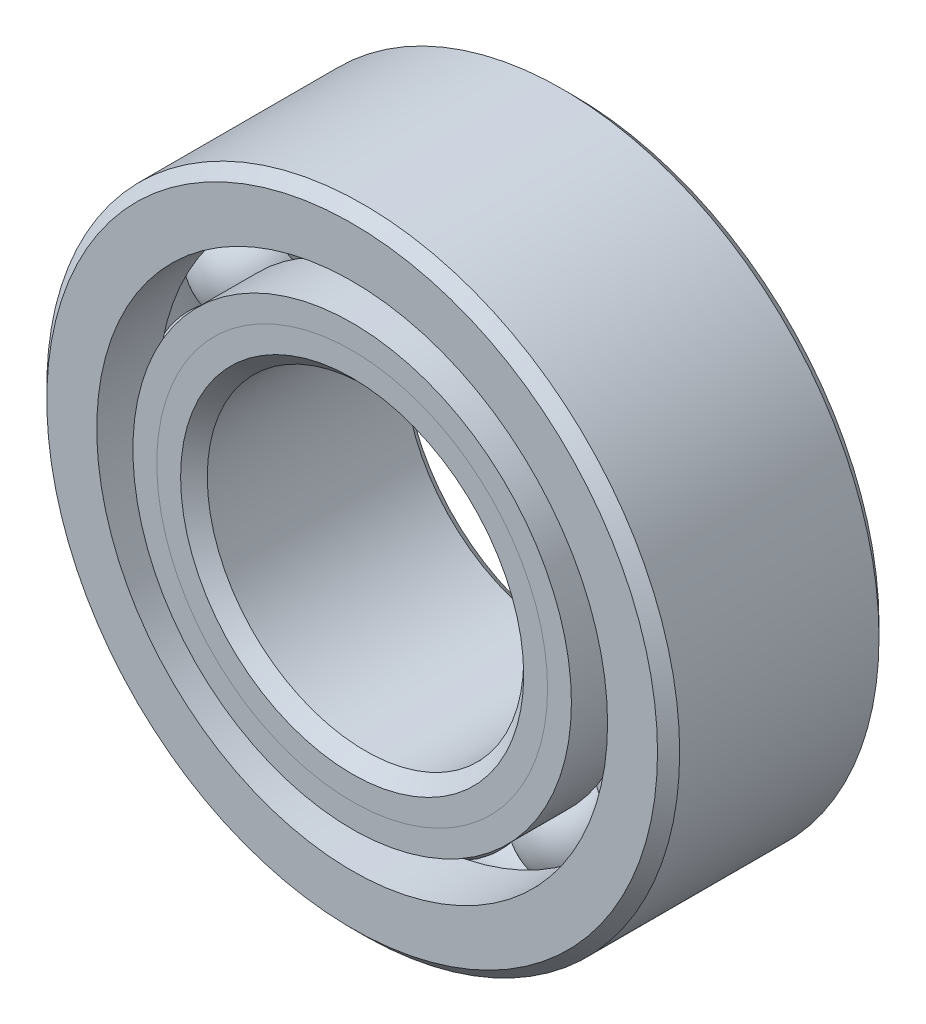
ISO-10303-21;
HEADER;
FILE_DESCRIPTION(('STEP AP214'),'2;1');
FILE_NAME('part.step','',(''),(''),'','','');
FILE_SCHEMA(('AUTOMOTIVE_DESIGN { 1 0 10303 214 1 1 1 1 }'));
ENDSEC;
DATA;
#1=APPLICATION_CONTEXT('core data for automotive mechanical design processes');
#2=APPLICATION_PROTOCOL_DEFINITION('international standard','automotive_design',2000,#1);
#3=PRODUCT_CONTEXT('',#1,'mechanical');
#4=PRODUCT('Part','Part','',(#3));
#5=PRODUCT_RELATED_PRODUCT_CATEGORY('part','',(#4));
#6=PRODUCT_DEFINITION_FORMATION('','',#4);
#7=PRODUCT_DEFINITION_CONTEXT('part definition',#1,'design');
#8=PRODUCT_DEFINITION('design','',#6,#7);
#9=PRODUCT_DEFINITION_SHAPE('','',#8);
#10=(LENGTH_UNIT() NAMED_UNIT(*) SI_UNIT(.MILLI.,.METRE.));
#11=(NAMED_UNIT(*) PLANE_ANGLE_UNIT() SI_UNIT($,.RADIAN.));
#12=(NAMED_UNIT(*) SI_UNIT($,.STERADIAN.) SOLID_ANGLE_UNIT());
#13=UNCERTAINTY_MEASURE_WITH_UNIT(LENGTH_MEASURE(1.E-05),#10,'distance_accuracy_value','');
#14=(GEOMETRIC_REPRESENTATION_CONTEXT(3) GLOBAL_UNCERTAINTY_ASSIGNED_CONTEXT((#13)) GLOBAL_UNIT_ASSIGNED_CONTEXT((#10,
#11,#12)) REPRESENTATION_CONTEXT('',''));
#15=CARTESIAN_POINT('',(0.,0.,0.));
#16=DIRECTION('',(0.,0.,1.));
#17=DIRECTION('',(1.,0.,0.));
#18=AXIS2_PLACEMENT_3D('',#15,#16,#17);
#19=CARTESIAN_POINT('',(-1.48828124999997,2.57777874095214,0.));
#20=DIRECTION('',(0.,0.,1.));
#21=DIRECTION('',(-0.499999999999989,0.866025403784445,0.));
#22=AXIS2_PLACEMENT_3D('',#19,#20,#21);
#23=SPHERICAL_SURFACE('',#22,0.657697880273631);
#24=CARTESIAN_POINT('',(-1.48828124999997,2.57777874095214,0.65769788027363));
#25=VERTEX_POINT('',#24);
#26=VERTEX_LOOP('',#25);
#27=FACE_BOUND('',#26,.T.);
#28=ADVANCED_FACE('F39',(#27),#23,.T.);
#29=CLOSED_SHELL('',(#28));
#30=MANIFOLD_SOLID_BREP('B2',#29);
#31=CARTESIAN_POINT('',(-2.5777787409521,1.48828125000003,0.));
#32=DIRECTION('',(0.,0.,1.));
#33=DIRECTION('',(-0.866025403784433,0.50000000000001,0.));
#34=AXIS2_PLACEMENT_3D('',#31,#32,#33);
#35=SPHERICAL_SURFACE('',#34,0.657697880273631);
#36=CARTESIAN_POINT('',(-2.5777787409521,1.48828125000003,0.65769788027363));
#37=VERTEX_POINT('',#36);
#38=VERTEX_LOOP('',#37);
#39=FACE_BOUND('',#38,.T.);
#40=ADVANCED_FACE('F71',(#39),#35,.T.);
#41=CLOSED_SHELL('',(#40));
#42=MANIFOLD_SOLID_BREP('B6',#41);
#43=CARTESIAN_POINT('',(-2.9765625,0.,0.));
#44=DIRECTION('',(0.,0.,1.));
#45=DIRECTION('',(-1.,0.,0.));
#46=AXIS2_PLACEMENT_3D('',#43,#44,#45);
#47=SPHERICAL_SURFACE('',#46,0.657697880273631);
#48=CARTESIAN_POINT('',(-2.9765625,0.,0.65769788027363));
#49=VERTEX_POINT('',#48);
#50=VERTEX_LOOP('',#49);
#51=FACE_BOUND('',#50,.T.);
#52=ADVANCED_FACE('F103',(#51),#47,.T.);
#53=CLOSED_SHELL('',(#52));
#54=MANIFOLD_SOLID_BREP('B35',#53);
#55=CARTESIAN_POINT('',(-2.57777874095213,-1.48828124999998,0.));
#56=DIRECTION('',(0.,0.,1.));
#57=DIRECTION('',(-0.866025403784443,-0.499999999999992,0.));
#58=AXIS2_PLACEMENT_3D('',#55,#56,#57);
#59=SPHERICAL_SURFACE('',#58,0.657697880273631);
#60=CARTESIAN_POINT('',(-2.57777874095213,-1.48828124999998,0.65769788027363));
#61=VERTEX_POINT('',#60);
#62=VERTEX_LOOP('',#61);
#63=FACE_BOUND('',#62,.T.);
#64=ADVANCED_FACE('F135',(#63),#59,.T.);
#65=CLOSED_SHELL('',(#64));
#66=MANIFOLD_SOLID_BREP('B67',#65);
#67=CARTESIAN_POINT('',(-1.48828125000002,-2.57777874095211,0.));
#68=DIRECTION('',(0.,0.,1.));
#69=DIRECTION('',(-0.500000000000007,-0.866025403784435,0.));
#70=AXIS2_PLACEMENT_3D('',#67,#68,#69);
#71=SPHERICAL_SURFACE('',#70,0.657697880273631);
#72=CARTESIAN_POINT('',(-1.48828125000002,-2.57777874095211,0.65769788027363));
#73=VERTEX_POINT('',#72);
#74=VERTEX_LOOP('',#73);
#75=FACE_BOUND('',#74,.T.);
#76=ADVANCED_FACE('F167',(#75),#71,.T.);
#77=CLOSED_SHELL('',(#76));
#78=MANIFOLD_SOLID_BREP('B99',#77);
#79=CARTESIAN_POINT('',(0.,-2.9765625,0.));
#80=DIRECTION('',(0.,0.,1.));
#81=DIRECTION('',(0.,-1.,0.));
#82=AXIS2_PLACEMENT_3D('',#79,#80,#81);
#83=SPHERICAL_SURFACE('',#82,0.657697880273631);
#84=CARTESIAN_POINT('',(0.,-2.9765625,0.65769788027363));
#85=VERTEX_POINT('',#84);
#86=VERTEX_LOOP('',#85);
#87=FACE_BOUND('',#86,.T.);
#88=ADVANCED_FACE('F199',(#87),#83,.T.);
#89=CLOSED_SHELL('',(#88));
#90=MANIFOLD_SOLID_BREP('B131',#89);
#91=CARTESIAN_POINT('',(1.48828124999999,-2.57777874095213,0.));
#92=DIRECTION('',(0.,0.,1.));
#93=DIRECTION('',(0.499999999999995,-0.866025403784442,0.));
#94=AXIS2_PLACEMENT_3D('',#91,#92,#93);
#95=SPHERICAL_SURFACE('',#94,0.657697880273631);
#96=CARTESIAN_POINT('',(1.48828124999999,-2.57777874095213,0.65769788027363));
#97=VERTEX_POINT('',#96);
#98=VERTEX_LOOP('',#97);
#99=FACE_BOUND('',#98,.T.);
#100=ADVANCED_FACE('F231',(#99),#95,.T.);
#101=CLOSED_SHELL('',(#100));
#102=MANIFOLD_SOLID_BREP('B163',#101);
#103=CARTESIAN_POINT('',(2.57777874095211,-1.48828125000001,0.));
#104=DIRECTION('',(0.,0.,1.));
#105=DIRECTION('',(0.866025403784436,-0.500000000000004,0.));
#106=AXIS2_PLACEMENT_3D('',#103,#104,#105);
#107=SPHERICAL_SURFACE('',#106,0.657697880273631);
#108=CARTESIAN_POINT('',(2.57777874095211,-1.48828125000001,0.65769788027363));
#109=VERTEX_POINT('',#108);
#110=VERTEX_LOOP('',#109);
#111=FACE_BOUND('',#110,.T.);
#112=ADVANCED_FACE('F263',(#111),#107,.T.);
#113=CLOSED_SHELL('',(#112));
#114=MANIFOLD_SOLID_BREP('B195',#113);
#115=CARTESIAN_POINT('',(2.9765625,0.,0.));
#116=DIRECTION('',(0.,0.,1.));
#117=DIRECTION('',(1.,0.,0.));
#118=AXIS2_PLACEMENT_3D('',#115,#116,#117);
#119=SPHERICAL_SURFACE('',#118,0.657697880273631);
#120=CARTESIAN_POINT('',(2.9765625,0.,0.65769788027363));
#121=VERTEX_POINT('',#120);
#122=VERTEX_LOOP('',#121);
#123=FACE_BOUND('',#122,.T.);
#124=ADVANCED_FACE('F295',(#123),#119,.T.);
#125=CLOSED_SHELL('',(#124));
#126=MANIFOLD_SOLID_BREP('B227',#125);
#127=CARTESIAN_POINT('',(2.57777874095212,1.48828124999999,0.));
#128=DIRECTION('',(0.,0.,1.));
#129=DIRECTION('',(0.86602540378444,0.499999999999998,0.));
#130=AXIS2_PLACEMENT_3D('',#127,#128,#129);
#131=SPHERICAL_SURFACE('',#130,0.657697880273631);
#132=CARTESIAN_POINT('',(2.57777874095212,1.48828124999999,0.65769788027363));
#133=VERTEX_POINT('',#132);
#134=VERTEX_LOOP('',#133);
#135=FACE_BOUND('',#134,.T.);
#136=ADVANCED_FACE('F327',(#135),#131,.T.);
#137=CLOSED_SHELL('',(#136));
#138=MANIFOLD_SOLID_BREP('B259',#137);
#139=CARTESIAN_POINT('',(1.48828125,2.57777874095212,0.));
#140=DIRECTION('',(0.,0.,1.));
#141=DIRECTION('',(0.500000000000001,0.866025403784438,0.));
#142=AXIS2_PLACEMENT_3D('',#139,#140,#141);
#143=SPHERICAL_SURFACE('',#142,0.657697880273631);
#144=CARTESIAN_POINT('',(1.48828125,2.57777874095212,0.65769788027363));
#145=VERTEX_POINT('',#144);
#146=VERTEX_LOOP('',#145);
#147=FACE_BOUND('',#146,.T.);
#148=ADVANCED_FACE('F359',(#147),#143,.T.);
#149=CLOSED_SHELL('',(#148));
#150=MANIFOLD_SOLID_BREP('B291',#149);
#151=CARTESIAN_POINT('',(0.,2.9765625,0.));
#152=DIRECTION('',(0.,0.,1.));
#153=DIRECTION('',(0.,1.,0.));
#154=AXIS2_PLACEMENT_3D('',#151,#152,#153);
#155=SPHERICAL_SURFACE('',#154,0.657697880273631);
#156=CARTESIAN_POINT('',(0.,2.9765625,0.65769788027363));
#157=VERTEX_POINT('',#156);
#158=VERTEX_LOOP('',#157);
#159=FACE_BOUND('',#158,.T.);
#160=ADVANCED_FACE('F393',(#159),#155,.T.);
#161=CLOSED_SHELL('',(#160));
#162=MANIFOLD_SOLID_BREP('B323',#161);
#163=CARTESIAN_POINT('',(0.,2.45069829778874,1.3890625));
#164=DIRECTION('',(0.,0.,-1.));
#165=DIRECTION('',(-1.,0.,0.));
#166=AXIS2_PLACEMENT_3D('',#163,#164,#165);
#167=PLANE('',#166);
#168=CARTESIAN_POINT('',(0.,0.,1.3890625));
#169=DIRECTION('',(0.,0.,1.));
#170=DIRECTION('',(1.,0.,0.));
#171=AXIS2_PLACEMENT_3D('',#168,#169,#170);
#172=CIRCLE('',#171,2.15161980986318);
#173=CARTESIAN_POINT('',(2.15161980986318,0.,1.3890625));
#174=VERTEX_POINT('',#173);
#175=EDGE_CURVE('E447',#174,#174,#172,.T.);
#176=ORIENTED_EDGE('',*,*,#175,.F.);
#177=EDGE_LOOP('',(#176));
#178=FACE_BOUND('',#177,.T.);
#179=CARTESIAN_POINT('',(0.,0.,1.3890625));
#180=DIRECTION('',(0.,0.,1.));
#181=DIRECTION('',(1.,0.,0.));
#182=AXIS2_PLACEMENT_3D('',#179,#180,#181);
#183=CIRCLE('',#182,2.45069829778874);
#184=CARTESIAN_POINT('',(2.45069829778874,0.,1.3890625));
#185=VERTEX_POINT('',#184);
#186=EDGE_CURVE('E392',#185,#185,#183,.T.);
#187=ORIENTED_EDGE('',*,*,#186,.T.);
#188=EDGE_LOOP('',(#187));
#189=FACE_BOUND('',#188,.T.);
#190=ADVANCED_FACE('F413',(#178,#189),#167,.F.);
#191=CARTESIAN_POINT('',(0.,0.,1.08998401207445));
#192=DIRECTION('',(0.,0.,1.));
#193=DIRECTION('',(1.,0.,0.));
#194=AXIS2_PLACEMENT_3D('',#191,#192,#193);
#195=CONICAL_SURFACE('',#194,2.15161980986318,0.78539816339745);
#196=ORIENTED_EDGE('',*,*,#186,.F.);
#197=EDGE_LOOP('',(#196));
#198=FACE_BOUND('',#197,.T.);
#199=CARTESIAN_POINT('',(0.,0.,1.08998401207445));
#200=DIRECTION('',(0.,0.,1.));
#201=DIRECTION('',(1.,0.,0.));
#202=AXIS2_PLACEMENT_3D('',#199,#200,#201);
#203=CIRCLE('',#202,2.15161980986318);
#204=CARTESIAN_POINT('',(2.15161980986318,0.,1.08998401207445));
#205=VERTEX_POINT('',#204);
#206=EDGE_CURVE('E419',#205,#205,#203,.T.);
#207=ORIENTED_EDGE('',*,*,#206,.T.);
#208=EDGE_LOOP('',(#207));
#209=FACE_BOUND('',#208,.T.);
#210=ADVANCED_FACE('F454',(#198,#209),#195,.T.);
#211=CARTESIAN_POINT('',(0.,0.,1.3890625));
#212=DIRECTION('',(0.,0.,1.));
#213=DIRECTION('',(1.,0.,0.));
#214=AXIS2_PLACEMENT_3D('',#211,#212,#213);
#215=CYLINDRICAL_SURFACE('',#214,2.15161980986318);
#216=ORIENTED_EDGE('',*,*,#206,.F.);
#217=EDGE_LOOP('',(#216));
#218=FACE_BOUND('',#217,.T.);
#219=CARTESIAN_POINT('',(0.,0.,0.));
#220=DIRECTION('',(0.,0.,1.));
#221=DIRECTION('',(1.,0.,0.));
#222=AXIS2_PLACEMENT_3D('',#219,#220,#221);
#223=CIRCLE('',#222,2.15161980986318);
#224=CARTESIAN_POINT('',(2.15161980986318,0.,0.));
#225=VERTEX_POINT('',#224);
#226=EDGE_CURVE('E423',#225,#225,#223,.T.);
#227=ORIENTED_EDGE('',*,*,#226,.T.);
#228=EDGE_LOOP('',(#227));
#229=FACE_BOUND('',#228,.T.);
#230=ADVANCED_FACE('F458',(#218,#229),#215,.T.);
#231=CARTESIAN_POINT('',(0.,2.15161980986318,0.));
#232=DIRECTION('',(0.,0.,-1.));
#233=DIRECTION('',(-1.,0.,0.));
#234=AXIS2_PLACEMENT_3D('',#231,#232,#233);
#235=PLANE('',#234);
#236=ORIENTED_EDGE('',*,*,#226,.F.);
#237=EDGE_LOOP('',(#236));
#238=FACE_BOUND('',#237,.T.);
#239=CARTESIAN_POINT('',(0.,0.,0.));
#240=DIRECTION('',(0.,0.,1.));
#241=DIRECTION('',(1.,0.,0.));
#242=AXIS2_PLACEMENT_3D('',#239,#240,#241);
#243=CIRCLE('',#242,2.31886461972637);
#244=CARTESIAN_POINT('',(2.31886461972637,0.,0.));
#245=VERTEX_POINT('',#244);
#246=EDGE_CURVE('E427',#245,#245,#243,.T.);
#247=ORIENTED_EDGE('',*,*,#246,.T.);
#248=EDGE_LOOP('',(#247));
#249=FACE_BOUND('',#248,.T.);
#250=ADVANCED_FACE('F463',(#238,#249),#235,.F.);
#251=CARTESIAN_POINT('',(0.,0.,0.));
#252=DIRECTION('',(0.,0.,1.));
#253=DIRECTION('',(1.,0.,0.));
#254=AXIS2_PLACEMENT_3D('',#251,#252,#253);
#255=TOROIDAL_SURFACE('',#254,2.9765625,0.65769788027363);
#256=ORIENTED_EDGE('',*,*,#246,.F.);
#257=EDGE_LOOP('',(#256));
#258=FACE_BOUND('',#257,.T.);
#259=CARTESIAN_POINT('',(0.,0.,-0.617361111111111));
#260=DIRECTION('',(0.,0.,1.));
#261=DIRECTION('',(1.,0.,0.));
#262=AXIS2_PLACEMENT_3D('',#259,#260,#261);
#263=CIRCLE('',#262,2.74977678571429);
#264=CARTESIAN_POINT('',(2.74977678571429,0.,-0.617361111111111));
#265=VERTEX_POINT('',#264);
#266=EDGE_CURVE('E432',#265,#265,#263,.T.);
#267=ORIENTED_EDGE('',*,*,#266,.T.);
#268=EDGE_LOOP('',(#267));
#269=FACE_BOUND('',#268,.T.);
#270=ADVANCED_FACE('F469',(#258,#269),#255,.F.);
#271=CARTESIAN_POINT('',(0.,0.,1.3890625));
#272=DIRECTION('',(0.,0.,1.));
#273=DIRECTION('',(1.,0.,0.));
#274=AXIS2_PLACEMENT_3D('',#271,#272,#273);
#275=CYLINDRICAL_SURFACE('',#274,2.74977678571429);
#276=ORIENTED_EDGE('',*,*,#266,.F.);
#277=EDGE_LOOP('',(#276));
#278=FACE_BOUND('',#277,.T.);
#279=CARTESIAN_POINT('',(0.,0.,-1.3890625));
#280=DIRECTION('',(0.,0.,1.));
#281=DIRECTION('',(1.,0.,0.));
#282=AXIS2_PLACEMENT_3D('',#279,#280,#281);
#283=CIRCLE('',#282,2.74977678571429);
#284=CARTESIAN_POINT('',(2.74977678571429,0.,-1.3890625));
#285=VERTEX_POINT('',#284);
#286=EDGE_CURVE('E435',#285,#285,#283,.T.);
#287=ORIENTED_EDGE('',*,*,#286,.T.);
#288=EDGE_LOOP('',(#287));
#289=FACE_BOUND('',#288,.T.);
#290=ADVANCED_FACE('F473',(#278,#289),#275,.T.);
#291=CARTESIAN_POINT('',(0.,2.12328125,-1.3890625));
#292=DIRECTION('',(0.,0.,1.));
#293=DIRECTION('',(1.,0.,0.));
#294=AXIS2_PLACEMENT_3D('',#291,#292,#293);
#295=PLANE('',#294);
#296=ORIENTED_EDGE('',*,*,#286,.F.);
#297=EDGE_LOOP('',(#296));
#298=FACE_BOUND('',#297,.T.);
#299=CARTESIAN_POINT('',(0.,0.,-1.3890625));
#300=DIRECTION('',(0.,0.,1.));
#301=DIRECTION('',(1.,0.,0.));
#302=AXIS2_PLACEMENT_3D('',#299,#300,#301);
#303=CIRCLE('',#302,2.12328125);
#304=CARTESIAN_POINT('',(2.12328125,0.,-1.3890625));
#305=VERTEX_POINT('',#304);
#306=EDGE_CURVE('E438',#305,#305,#303,.T.);
#307=ORIENTED_EDGE('',*,*,#306,.T.);
#308=EDGE_LOOP('',(#307));
#309=FACE_BOUND('',#308,.T.);
#310=ADVANCED_FACE('F477',(#298,#309),#295,.F.);
#311=CARTESIAN_POINT('',(0.,0.,-1.25015625));
#312=DIRECTION('',(0.,0.,-1.));
#313=DIRECTION('',(-1.,0.,0.));
#314=AXIS2_PLACEMENT_3D('',#311,#312,#313);
#315=CONICAL_SURFACE('',#314,1.984375,0.785398163397448);
#316=ORIENTED_EDGE('',*,*,#306,.F.);
#317=EDGE_LOOP('',(#316));
#318=FACE_BOUND('',#317,.T.);
#319=CARTESIAN_POINT('',(0.,0.,-1.25015625));
#320=DIRECTION('',(0.,0.,1.));
#321=DIRECTION('',(1.,0.,0.));
#322=AXIS2_PLACEMENT_3D('',#319,#320,#321);
#323=CIRCLE('',#322,1.984375);
#324=CARTESIAN_POINT('',(1.984375,0.,-1.25015625));
#325=VERTEX_POINT('',#324);
#326=EDGE_CURVE('E441',#325,#325,#323,.T.);
#327=ORIENTED_EDGE('',*,*,#326,.T.);
#328=EDGE_LOOP('',(#327));
#329=FACE_BOUND('',#328,.T.);
#330=ADVANCED_FACE('F481',(#318,#329),#315,.F.);
#331=CARTESIAN_POINT('',(0.,0.,1.3890625));
#332=DIRECTION('',(0.,0.,1.));
#333=DIRECTION('',(1.,0.,0.));
#334=AXIS2_PLACEMENT_3D('',#331,#332,#333);
#335=CYLINDRICAL_SURFACE('',#334,1.984375);
#336=ORIENTED_EDGE('',*,*,#326,.F.);
#337=EDGE_LOOP('',(#336));
#338=FACE_BOUND('',#337,.T.);
#339=CARTESIAN_POINT('',(0.,0.,1.22181769013682));
#340=DIRECTION('',(0.,0.,1.));
#341=DIRECTION('',(1.,0.,0.));
#342=AXIS2_PLACEMENT_3D('',#339,#340,#341);
#343=CIRCLE('',#342,1.984375);
#344=CARTESIAN_POINT('',(1.984375,0.,1.22181769013682));
#345=VERTEX_POINT('',#344);
#346=EDGE_CURVE('E444',#345,#345,#343,.T.);
#347=ORIENTED_EDGE('',*,*,#346,.T.);
#348=EDGE_LOOP('',(#347));
#349=FACE_BOUND('',#348,.T.);
#350=ADVANCED_FACE('F485',(#338,#349),#335,.F.);
#351=CARTESIAN_POINT('',(0.,0.,1.3890625));
#352=DIRECTION('',(0.,0.,1.));
#353=DIRECTION('',(1.,0.,0.));
#354=AXIS2_PLACEMENT_3D('',#351,#352,#353);
#355=CONICAL_SURFACE('',#354,2.15161980986318,0.78539816339745);
#356=ORIENTED_EDGE('',*,*,#346,.F.);
#357=EDGE_LOOP('',(#356));
#358=FACE_BOUND('',#357,.T.);
#359=ORIENTED_EDGE('',*,*,#175,.T.);
#360=EDGE_LOOP('',(#359));
#361=FACE_BOUND('',#360,.T.);
#362=ADVANCED_FACE('F451',(#358,#361),#355,.F.);
#363=CLOSED_SHELL('',(#190,#210,#230,#250,#270,#290,#310,#330,#350,#362));
#364=MANIFOLD_SOLID_BREP('B355',#363);
#365=CARTESIAN_POINT('',(0.,2.74977678571429,1.3890625));
#366=DIRECTION('',(0.,0.,-1.));
#367=DIRECTION('',(-1.,0.,0.));
#368=AXIS2_PLACEMENT_3D('',#365,#366,#367);
#369=PLANE('',#368);
#370=CARTESIAN_POINT('',(0.,0.,1.3890625));
#371=DIRECTION('',(0.,0.,1.));
#372=DIRECTION('',(1.,0.,0.));
#373=AXIS2_PLACEMENT_3D('',#370,#371,#372);
#374=CIRCLE('',#373,2.45069829778874);
#375=CARTESIAN_POINT('',(2.45069829778874,0.,1.3890625));
#376=VERTEX_POINT('',#375);
#377=EDGE_CURVE('E412',#376,#376,#374,.T.);
#378=ORIENTED_EDGE('',*,*,#377,.F.);
#379=EDGE_LOOP('',(#378));
#380=FACE_BOUND('',#379,.T.);
#381=CARTESIAN_POINT('',(0.,0.,1.3890625));
#382=DIRECTION('',(0.,0.,1.));
#383=DIRECTION('',(1.,0.,0.));
#384=AXIS2_PLACEMENT_3D('',#381,#382,#383);
#385=CIRCLE('',#384,2.74977678571429);
#386=CARTESIAN_POINT('',(2.74977678571429,0.,1.3890625));
#387=VERTEX_POINT('',#386);
#388=EDGE_CURVE('E593',#387,#387,#385,.T.);
#389=ORIENTED_EDGE('',*,*,#388,.T.);
#390=EDGE_LOOP('',(#389));
#391=FACE_BOUND('',#390,.T.);
#392=ADVANCED_FACE('F571',(#380,#391),#369,.F.);
#393=CARTESIAN_POINT('',(0.,0.,1.3890625));
#394=DIRECTION('',(0.,0.,1.));
#395=DIRECTION('',(1.,0.,0.));
#396=AXIS2_PLACEMENT_3D('',#393,#394,#395);
#397=CONICAL_SURFACE('',#396,2.45069829778874,0.78539816339745);
#398=CARTESIAN_POINT('',(0.,0.,1.08998401207445));
#399=DIRECTION('',(0.,0.,1.));
#400=DIRECTION('',(1.,0.,0.));
#401=AXIS2_PLACEMENT_3D('',#398,#399,#400);
#402=CIRCLE('',#401,2.15161980986318);
#403=CARTESIAN_POINT('',(2.15161980986318,0.,1.08998401207445));
#404=VERTEX_POINT('',#403);
#405=EDGE_CURVE('E577',#404,#404,#402,.T.);
#406=ORIENTED_EDGE('',*,*,#405,.F.);
#407=EDGE_LOOP('',(#406));
#408=FACE_BOUND('',#407,.T.);
#409=ORIENTED_EDGE('',*,*,#377,.T.);
#410=EDGE_LOOP('',(#409));
#411=FACE_BOUND('',#410,.T.);
#412=ADVANCED_FACE('F618',(#408,#411),#397,.F.);
#413=CARTESIAN_POINT('',(0.,0.,1.3890625));
#414=DIRECTION('',(0.,0.,1.));
#415=DIRECTION('',(1.,0.,0.));
#416=AXIS2_PLACEMENT_3D('',#413,#414,#415);
#417=CYLINDRICAL_SURFACE('',#416,2.15161980986318);
#418=CARTESIAN_POINT('',(0.,0.,0.));
#419=DIRECTION('',(0.,0.,1.));
#420=DIRECTION('',(1.,0.,0.));
#421=AXIS2_PLACEMENT_3D('',#418,#419,#420);
#422=CIRCLE('',#421,2.15161980986318);
#423=CARTESIAN_POINT('',(2.15161980986318,0.,0.));
#424=VERTEX_POINT('',#423);
#425=EDGE_CURVE('E581',#424,#424,#422,.T.);
#426=ORIENTED_EDGE('',*,*,#425,.F.);
#427=EDGE_LOOP('',(#426));
#428=FACE_BOUND('',#427,.T.);
#429=ORIENTED_EDGE('',*,*,#405,.T.);
#430=EDGE_LOOP('',(#429));
#431=FACE_BOUND('',#430,.T.);
#432=ADVANCED_FACE('F613',(#428,#431),#417,.F.);
#433=CARTESIAN_POINT('',(0.,2.15161980986318,0.));
#434=DIRECTION('',(0.,0.,1.));
#435=DIRECTION('',(1.,0.,0.));
#436=AXIS2_PLACEMENT_3D('',#433,#434,#435);
#437=PLANE('',#436);
#438=CARTESIAN_POINT('',(0.,0.,0.));
#439=DIRECTION('',(0.,0.,1.));
#440=DIRECTION('',(1.,0.,0.));
#441=AXIS2_PLACEMENT_3D('',#438,#439,#440);
#442=CIRCLE('',#441,2.31886461972637);
#443=CARTESIAN_POINT('',(2.31886461972637,0.,0.));
#444=VERTEX_POINT('',#443);
#445=EDGE_CURVE('E585',#444,#444,#442,.T.);
#446=ORIENTED_EDGE('',*,*,#445,.F.);
#447=EDGE_LOOP('',(#446));
#448=FACE_BOUND('',#447,.T.);
#449=ORIENTED_EDGE('',*,*,#425,.T.);
#450=EDGE_LOOP('',(#449));
#451=FACE_BOUND('',#450,.T.);
#452=ADVANCED_FACE('F607',(#448,#451),#437,.F.);
#453=CARTESIAN_POINT('',(0.,0.,0.));
#454=DIRECTION('',(0.,0.,1.));
#455=DIRECTION('',(1.,0.,0.));
#456=AXIS2_PLACEMENT_3D('',#453,#454,#455);
#457=TOROIDAL_SURFACE('',#456,2.9765625,0.657697880273631);
#458=CARTESIAN_POINT('',(0.,0.,0.617361111111111));
#459=DIRECTION('',(0.,0.,1.));
#460=DIRECTION('',(1.,0.,0.));
#461=AXIS2_PLACEMENT_3D('',#458,#459,#460);
#462=CIRCLE('',#461,2.74977678571429);
#463=CARTESIAN_POINT('',(2.74977678571429,0.,0.617361111111111));
#464=VERTEX_POINT('',#463);
#465=EDGE_CURVE('E590',#464,#464,#462,.T.);
#466=ORIENTED_EDGE('',*,*,#465,.F.);
#467=EDGE_LOOP('',(#466));
#468=FACE_BOUND('',#467,.T.);
#469=ORIENTED_EDGE('',*,*,#445,.T.);
#470=EDGE_LOOP('',(#469));
#471=FACE_BOUND('',#470,.T.);
#472=ADVANCED_FACE('F601',(#468,#471),#457,.F.);
#473=CARTESIAN_POINT('',(0.,0.,1.3890625));
#474=DIRECTION('',(0.,0.,1.));
#475=DIRECTION('',(1.,0.,0.));
#476=AXIS2_PLACEMENT_3D('',#473,#474,#475);
#477=CYLINDRICAL_SURFACE('',#476,2.74977678571429);
#478=ORIENTED_EDGE('',*,*,#388,.F.);
#479=EDGE_LOOP('',(#478));
#480=FACE_BOUND('',#479,.T.);
#481=ORIENTED_EDGE('',*,*,#465,.T.);
#482=EDGE_LOOP('',(#481));
#483=FACE_BOUND('',#482,.T.);
#484=ADVANCED_FACE('F598',(#480,#483),#477,.T.);
#485=CLOSED_SHELL('',(#392,#412,#432,#452,#472,#484));
#486=MANIFOLD_SOLID_BREP('B387',#485);
#487=CARTESIAN_POINT('',(0.,0.,1.25015625));
#488=DIRECTION('',(0.,0.,-1.));
#489=DIRECTION('',(-1.,0.,0.));
#490=AXIS2_PLACEMENT_3D('',#487,#488,#489);
#491=CONICAL_SURFACE('',#490,3.96875,0.785398163397445);
#492=CARTESIAN_POINT('',(0.,0.,1.3890625));
#493=DIRECTION('',(0.,0.,1.));
#494=DIRECTION('',(1.,0.,0.));
#495=AXIS2_PLACEMENT_3D('',#492,#493,#494);
#496=CIRCLE('',#495,3.82984375);
#497=CARTESIAN_POINT('',(3.82984375,0.,1.3890625));
#498=VERTEX_POINT('',#497);
#499=EDGE_CURVE('E690',#498,#498,#496,.T.);
#500=ORIENTED_EDGE('',*,*,#499,.F.);
#501=EDGE_LOOP('',(#500));
#502=FACE_BOUND('',#501,.T.);
#503=CARTESIAN_POINT('',(0.,0.,1.25015625));
#504=DIRECTION('',(0.,0.,1.));
#505=DIRECTION('',(1.,0.,0.));
#506=AXIS2_PLACEMENT_3D('',#503,#504,#505);
#507=CIRCLE('',#506,3.96875);
#508=CARTESIAN_POINT('',(3.96875,0.,1.25015625));
#509=VERTEX_POINT('',#508);
#510=EDGE_CURVE('E570',#509,#509,#507,.T.);
#511=ORIENTED_EDGE('',*,*,#510,.T.);
#512=EDGE_LOOP('',(#511));
#513=FACE_BOUND('',#512,.T.);
#514=ADVANCED_FACE('F662',(#502,#513),#491,.T.);
#515=CARTESIAN_POINT('',(0.,0.,1.3890625));
#516=DIRECTION('',(0.,0.,1.));
#517=DIRECTION('',(1.,0.,0.));
#518=AXIS2_PLACEMENT_3D('',#515,#516,#517);
#519=CYLINDRICAL_SURFACE('',#518,3.96875);
#520=ORIENTED_EDGE('',*,*,#510,.F.);
#521=EDGE_LOOP('',(#520));
#522=FACE_BOUND('',#521,.T.);
#523=CARTESIAN_POINT('',(0.,0.,-1.25015625));
#524=DIRECTION('',(0.,0.,1.));
#525=DIRECTION('',(1.,0.,0.));
#526=AXIS2_PLACEMENT_3D('',#523,#524,#525);
#527=CIRCLE('',#526,3.96875);
#528=CARTESIAN_POINT('',(3.96875,0.,-1.25015625));
#529=VERTEX_POINT('',#528);
#530=EDGE_CURVE('E668',#529,#529,#527,.T.);
#531=ORIENTED_EDGE('',*,*,#530,.T.);
#532=EDGE_LOOP('',(#531));
#533=FACE_BOUND('',#532,.T.);
#534=ADVANCED_FACE('F697',(#522,#533),#519,.T.);
#535=CARTESIAN_POINT('',(0.,0.,-1.3890625));
#536=DIRECTION('',(0.,0.,1.));
#537=DIRECTION('',(1.,0.,0.));
#538=AXIS2_PLACEMENT_3D('',#535,#536,#537);
#539=CONICAL_SURFACE('',#538,3.82984375,0.785398163397442);
#540=ORIENTED_EDGE('',*,*,#530,.F.);
#541=EDGE_LOOP('',(#540));
#542=FACE_BOUND('',#541,.T.);
#543=CARTESIAN_POINT('',(0.,0.,-1.3890625));
#544=DIRECTION('',(0.,0.,1.));
#545=DIRECTION('',(1.,0.,0.));
#546=AXIS2_PLACEMENT_3D('',#543,#544,#545);
#547=CIRCLE('',#546,3.82984375);
#548=CARTESIAN_POINT('',(3.82984375,0.,-1.3890625));
#549=VERTEX_POINT('',#548);
#550=EDGE_CURVE('E672',#549,#549,#547,.T.);
#551=ORIENTED_EDGE('',*,*,#550,.T.);
#552=EDGE_LOOP('',(#551));
#553=FACE_BOUND('',#552,.T.);
#554=ADVANCED_FACE('F701',(#542,#553),#539,.T.);
#555=CARTESIAN_POINT('',(0.,3.82984375,-1.3890625));
#556=DIRECTION('',(0.,0.,1.));
#557=DIRECTION('',(1.,0.,0.));
#558=AXIS2_PLACEMENT_3D('',#555,#556,#557);
#559=PLANE('',#558);
#560=ORIENTED_EDGE('',*,*,#550,.F.);
#561=EDGE_LOOP('',(#560));
#562=FACE_BOUND('',#561,.T.);
#563=CARTESIAN_POINT('',(0.,0.,-1.3890625));
#564=DIRECTION('',(0.,0.,1.));
#565=DIRECTION('',(1.,0.,0.));
#566=AXIS2_PLACEMENT_3D('',#563,#564,#565);
#567=CIRCLE('',#566,3.20334821428571);
#568=CARTESIAN_POINT('',(3.20334821428571,0.,-1.3890625));
#569=VERTEX_POINT('',#568);
#570=EDGE_CURVE('E676',#569,#569,#567,.T.);
#571=ORIENTED_EDGE('',*,*,#570,.T.);
#572=EDGE_LOOP('',(#571));
#573=FACE_BOUND('',#572,.T.);
#574=ADVANCED_FACE('F706',(#562,#573),#559,.F.);
#575=CARTESIAN_POINT('',(0.,0.,1.3890625));
#576=DIRECTION('',(0.,0.,1.));
#577=DIRECTION('',(1.,0.,0.));
#578=AXIS2_PLACEMENT_3D('',#575,#576,#577);
#579=CYLINDRICAL_SURFACE('',#578,3.20334821428571);
#580=ORIENTED_EDGE('',*,*,#570,.F.);
#581=EDGE_LOOP('',(#580));
#582=FACE_BOUND('',#581,.T.);
#583=CARTESIAN_POINT('',(0.,0.,-0.617361111111112));
#584=DIRECTION('',(0.,0.,1.));
#585=DIRECTION('',(1.,0.,0.));
#586=AXIS2_PLACEMENT_3D('',#583,#584,#585);
#587=CIRCLE('',#586,3.20334821428571);
#588=CARTESIAN_POINT('',(3.20334821428571,0.,-0.617361111111112));
#589=VERTEX_POINT('',#588);
#590=EDGE_CURVE('E681',#589,#589,#587,.T.);
#591=ORIENTED_EDGE('',*,*,#590,.T.);
#592=EDGE_LOOP('',(#591));
#593=FACE_BOUND('',#592,.T.);
#594=ADVANCED_FACE('F712',(#582,#593),#579,.F.);
#595=CARTESIAN_POINT('',(0.,0.,0.));
#596=DIRECTION('',(0.,0.,1.));
#597=DIRECTION('',(1.,0.,0.));
#598=AXIS2_PLACEMENT_3D('',#595,#596,#597);
#599=TOROIDAL_SURFACE('',#598,2.9765625,0.657697880273631);
#600=ORIENTED_EDGE('',*,*,#590,.F.);
#601=EDGE_LOOP('',(#600));
#602=FACE_BOUND('',#601,.T.);
#603=CARTESIAN_POINT('',(0.,0.,0.617361111111111));
#604=DIRECTION('',(0.,0.,1.));
#605=DIRECTION('',(1.,0.,0.));
#606=AXIS2_PLACEMENT_3D('',#603,#604,#605);
#607=CIRCLE('',#606,3.20334821428571);
#608=CARTESIAN_POINT('',(3.20334821428571,0.,0.617361111111111));
#609=VERTEX_POINT('',#608);
#610=EDGE_CURVE('E684',#609,#609,#607,.T.);
#611=ORIENTED_EDGE('',*,*,#610,.T.);
#612=EDGE_LOOP('',(#611));
#613=FACE_BOUND('',#612,.T.);
#614=ADVANCED_FACE('F716',(#602,#613),#599,.F.);
#615=CARTESIAN_POINT('',(0.,0.,1.3890625));
#616=DIRECTION('',(0.,0.,1.));
#617=DIRECTION('',(1.,0.,0.));
#618=AXIS2_PLACEMENT_3D('',#615,#616,#617);
#619=CYLINDRICAL_SURFACE('',#618,3.20334821428571);
#620=ORIENTED_EDGE('',*,*,#610,.F.);
#621=EDGE_LOOP('',(#620));
#622=FACE_BOUND('',#621,.T.);
#623=CARTESIAN_POINT('',(0.,0.,1.3890625));
#624=DIRECTION('',(0.,0.,1.));
#625=DIRECTION('',(1.,0.,0.));
#626=AXIS2_PLACEMENT_3D('',#623,#624,#625);
#627=CIRCLE('',#626,3.20334821428571);
#628=CARTESIAN_POINT('',(3.20334821428571,0.,1.3890625));
#629=VERTEX_POINT('',#628);
#630=EDGE_CURVE('E687',#629,#629,#627,.T.);
#631=ORIENTED_EDGE('',*,*,#630,.T.);
#632=EDGE_LOOP('',(#631));
#633=FACE_BOUND('',#632,.T.);
#634=ADVANCED_FACE('F720',(#622,#633),#619,.F.);
#635=CARTESIAN_POINT('',(0.,3.82984375,1.3890625));
#636=DIRECTION('',(0.,0.,-1.));
#637=DIRECTION('',(-1.,0.,0.));
#638=AXIS2_PLACEMENT_3D('',#635,#636,#637);
#639=PLANE('',#638);
#640=ORIENTED_EDGE('',*,*,#630,.F.);
#641=EDGE_LOOP('',(#640));
#642=FACE_BOUND('',#641,.T.);
#643=ORIENTED_EDGE('',*,*,#499,.T.);
#644=EDGE_LOOP('',(#643));
#645=FACE_BOUND('',#644,.T.);
#646=ADVANCED_FACE('F694',(#642,#645),#639,.F.);
#647=CLOSED_SHELL('',(#514,#534,#554,#574,#594,#614,#634,#646));
#648=MANIFOLD_SOLID_BREP('B407',#647);
#649=ADVANCED_BREP_SHAPE_REPRESENTATION('',(#18,#30,#42,#54,#66,#78,#90,#102,#114,#126,#138,
#150,#162,#364,#486,#648),#14);
#650=SHAPE_DEFINITION_REPRESENTATION(#9,#649);
ENDSEC;
END-ISO-10303-21;
